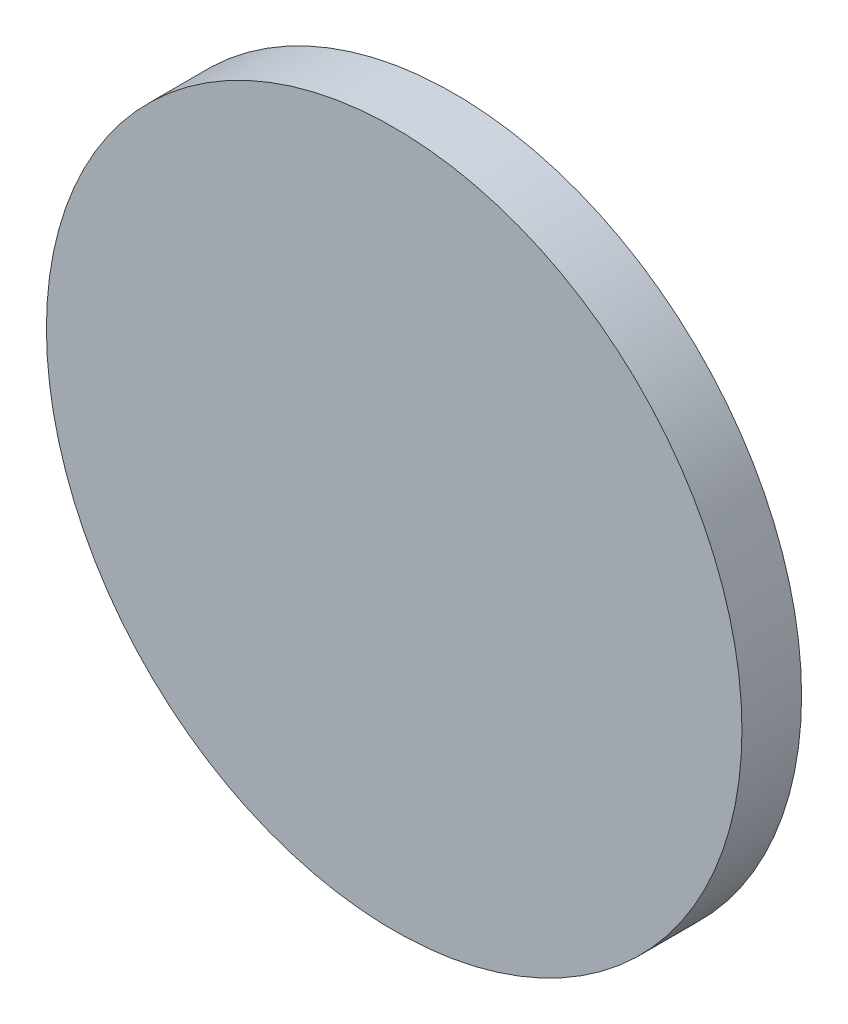
ISO-10303-21;
HEADER;
FILE_DESCRIPTION(('STEP AP214'),'2;1');
FILE_NAME('part.step','',(''),(''),'','','');
FILE_SCHEMA(('AUTOMOTIVE_DESIGN { 1 0 10303 214 1 1 1 1 }'));
ENDSEC;
DATA;
#1=APPLICATION_CONTEXT('core data for automotive mechanical design processes');
#2=APPLICATION_PROTOCOL_DEFINITION('international standard','automotive_design',2000,#1);
#3=PRODUCT_CONTEXT('',#1,'mechanical');
#4=PRODUCT('Part','Part','',(#3));
#5=PRODUCT_RELATED_PRODUCT_CATEGORY('part','',(#4));
#6=PRODUCT_DEFINITION_FORMATION('','',#4);
#7=PRODUCT_DEFINITION_CONTEXT('part definition',#1,'design');
#8=PRODUCT_DEFINITION('design','',#6,#7);
#9=PRODUCT_DEFINITION_SHAPE('','',#8);
#10=(LENGTH_UNIT() NAMED_UNIT(*) SI_UNIT(.MILLI.,.METRE.));
#11=(NAMED_UNIT(*) PLANE_ANGLE_UNIT() SI_UNIT($,.RADIAN.));
#12=(NAMED_UNIT(*) SI_UNIT($,.STERADIAN.) SOLID_ANGLE_UNIT());
#13=UNCERTAINTY_MEASURE_WITH_UNIT(LENGTH_MEASURE(1.E-05),#10,'distance_accuracy_value','');
#14=(GEOMETRIC_REPRESENTATION_CONTEXT(3) GLOBAL_UNCERTAINTY_ASSIGNED_CONTEXT((#13)) GLOBAL_UNIT_ASSIGNED_CONTEXT((#10,
#11,#12)) REPRESENTATION_CONTEXT('',''));
#15=CARTESIAN_POINT('',(0.,0.,0.));
#16=DIRECTION('',(0.,0.,1.));
#17=DIRECTION('',(1.,0.,0.));
#18=AXIS2_PLACEMENT_3D('',#15,#16,#17);
#19=CARTESIAN_POINT('',(9.604,4.807000014875,0.));
#20=DIRECTION('',(0.,0.,-1.));
#21=DIRECTION('',(-1.,0.,0.));
#22=AXIS2_PLACEMENT_3D('',#19,#20,#21);
#23=PLANE('',#22);
#24=CARTESIAN_POINT('',(9.604,4.807000014875,0.));
#25=DIRECTION('',(0.,0.,1.));
#26=DIRECTION('',(1.,0.,0.));
#27=AXIS2_PLACEMENT_3D('',#24,#25,#26);
#28=CIRCLE('',#27,0.200024667);
#29=CARTESIAN_POINT('',(9.804024667,4.807000014875,0.));
#30=VERTEX_POINT('',#29);
#31=EDGE_CURVE('E18',#30,#30,#28,.T.);
#32=ORIENTED_EDGE('',*,*,#31,.F.);
#33=EDGE_LOOP('',(#32));
#34=FACE_BOUND('',#33,.T.);
#35=ADVANCED_FACE('F15',(#34),#23,.T.);
#36=CARTESIAN_POINT('',(9.604,4.807000014875,0.));
#37=DIRECTION('',(0.,0.,1.));
#38=DIRECTION('',(1.,0.,0.));
#39=AXIS2_PLACEMENT_3D('',#36,#37,#38);
#40=CYLINDRICAL_SURFACE('',#39,0.200024667);
#41=CARTESIAN_POINT('',(9.604,4.807000014875,0.03429));
#42=DIRECTION('',(0.,0.,1.));
#43=DIRECTION('',(1.,0.,0.));
#44=AXIS2_PLACEMENT_3D('',#41,#42,#43);
#45=CIRCLE('',#44,0.200024667);
#46=CARTESIAN_POINT('',(9.804024667,4.807000014875,0.03429));
#47=VERTEX_POINT('',#46);
#48=EDGE_CURVE('E10',#47,#47,#45,.T.);
#49=ORIENTED_EDGE('',*,*,#48,.F.);
#50=EDGE_LOOP('',(#49));
#51=FACE_BOUND('',#50,.T.);
#52=ORIENTED_EDGE('',*,*,#31,.T.);
#53=EDGE_LOOP('',(#52));
#54=FACE_BOUND('',#53,.T.);
#55=ADVANCED_FACE('F27',(#51,#54),#40,.T.);
#56=CARTESIAN_POINT('',(9.604,4.807000014875,0.03429));
#57=DIRECTION('',(0.,0.,1.));
#58=DIRECTION('',(1.,0.,0.));
#59=AXIS2_PLACEMENT_3D('',#56,#57,#58);
#60=PLANE('',#59);
#61=ORIENTED_EDGE('',*,*,#48,.T.);
#62=EDGE_LOOP('',(#61));
#63=FACE_BOUND('',#62,.T.);
#64=ADVANCED_FACE('F34',(#63),#60,.T.);
#65=CLOSED_SHELL('',(#35,#55,#64));
#66=MANIFOLD_SOLID_BREP('B1',#65);
#67=ADVANCED_BREP_SHAPE_REPRESENTATION('',(#18,#66),#14);
#68=SHAPE_DEFINITION_REPRESENTATION(#9,#67);
ENDSEC;
END-ISO-10303-21;
